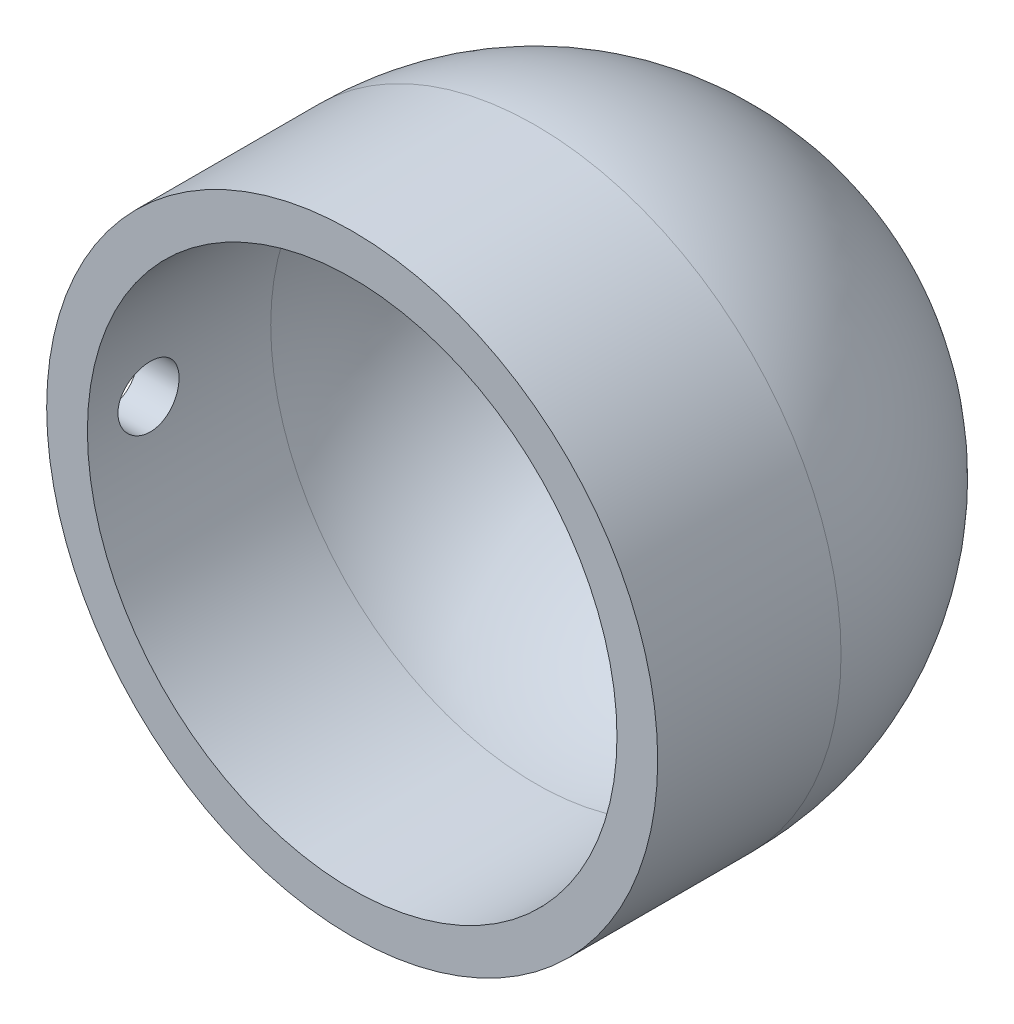
ISO-10303-21;
HEADER;
FILE_DESCRIPTION(('STEP AP214'),'2;1');
FILE_NAME('part.step','',(''),(''),'','','');
FILE_SCHEMA(('AUTOMOTIVE_DESIGN { 1 0 10303 214 1 1 1 1 }'));
ENDSEC;
DATA;
#1=APPLICATION_CONTEXT('core data for automotive mechanical design processes');
#2=APPLICATION_PROTOCOL_DEFINITION('international standard','automotive_design',2000,#1);
#3=PRODUCT_CONTEXT('',#1,'mechanical');
#4=PRODUCT('Part','Part','',(#3));
#5=PRODUCT_RELATED_PRODUCT_CATEGORY('part','',(#4));
#6=PRODUCT_DEFINITION_FORMATION('','',#4);
#7=PRODUCT_DEFINITION_CONTEXT('part definition',#1,'design');
#8=PRODUCT_DEFINITION('design','',#6,#7);
#9=PRODUCT_DEFINITION_SHAPE('','',#8);
#10=(LENGTH_UNIT() NAMED_UNIT(*) SI_UNIT(.MILLI.,.METRE.));
#11=(NAMED_UNIT(*) PLANE_ANGLE_UNIT() SI_UNIT($,.RADIAN.));
#12=(NAMED_UNIT(*) SI_UNIT($,.STERADIAN.) SOLID_ANGLE_UNIT());
#13=UNCERTAINTY_MEASURE_WITH_UNIT(LENGTH_MEASURE(1.E-05),#10,'distance_accuracy_value','');
#14=(GEOMETRIC_REPRESENTATION_CONTEXT(3) GLOBAL_UNCERTAINTY_ASSIGNED_CONTEXT((#13)) GLOBAL_UNIT_ASSIGNED_CONTEXT((#10,
#11,#12)) REPRESENTATION_CONTEXT('',''));
#15=CARTESIAN_POINT('',(0.,0.,0.));
#16=DIRECTION('',(0.,0.,1.));
#17=DIRECTION('',(1.,0.,0.));
#18=AXIS2_PLACEMENT_3D('',#15,#16,#17);
#19=CARTESIAN_POINT('',(15.,0.,-26.3920005806907));
#20=DIRECTION('',(0.,0.,-1.));
#21=DIRECTION('',(-1.,0.,0.));
#22=AXIS2_PLACEMENT_3D('',#19,#20,#21);
#23=CYLINDRICAL_SURFACE('',#22,13.);
#24=CARTESIAN_POINT('',(15.,0.,8.99999999999999));
#25=DIRECTION('',(0.,0.,-1.));
#26=DIRECTION('',(-1.,0.,0.));
#27=AXIS2_PLACEMENT_3D('',#24,#25,#26);
#28=CIRCLE('',#27,13.);
#29=CARTESIAN_POINT('',(2.,0.,8.99999999999999));
#30=VERTEX_POINT('',#29);
#31=EDGE_CURVE('E68',#30,#30,#28,.T.);
#32=ORIENTED_EDGE('',*,*,#31,.F.);
#33=EDGE_LOOP('',(#32));
#34=FACE_BOUND('',#33,.T.);
#35=CARTESIAN_POINT('',(15.,0.,0.));
#36=DIRECTION('',(0.,0.,-1.));
#37=DIRECTION('',(-1.,0.,0.));
#38=AXIS2_PLACEMENT_3D('',#35,#36,#37);
#39=CIRCLE('',#38,13.);
#40=CARTESIAN_POINT('',(2.,0.,0.));
#41=VERTEX_POINT('',#40);
#42=EDGE_CURVE('E52',#41,#41,#39,.T.);
#43=ORIENTED_EDGE('',*,*,#42,.T.);
#44=EDGE_LOOP('',(#43));
#45=FACE_BOUND('',#44,.T.);
#46=CARTESIAN_POINT('',(2.,0.,7.49999999999999));
#47=CARTESIAN_POINT('',(2.00000109554849,-0.0839563147427423,7.49999640316709));
#48=CARTESIAN_POINT('',(2.00082191842796,-0.167966345196188,7.49292758496519));
#49=CARTESIAN_POINT('',(2.00401740038599,-0.333652235419372,7.46483826496662));
#50=CARTESIAN_POINT('',(2.00639371863995,-0.415325505475653,7.44380286531638));
#51=CARTESIAN_POINT('',(2.01243226481309,-0.57391497224922,7.38840533385724));
#52=CARTESIAN_POINT('',(2.01609366337935,-0.650834199520698,7.35405179569065));
#53=CARTESIAN_POINT('',(2.02429425264015,-0.79779979378714,7.27301111812132));
#54=CARTESIAN_POINT('',(2.02883328291911,-0.867847413269117,7.22632623210123));
#55=CARTESIAN_POINT('',(2.03830564487917,-0.999427807179226,7.12171196440117));
#56=CARTESIAN_POINT('',(2.04324055671679,-1.06092347729183,7.06373605262275));
#57=CARTESIAN_POINT('',(2.05293561442349,-1.17333502414497,6.93828516324756));
#58=CARTESIAN_POINT('',(2.05769575172569,-1.2242503828419,6.87080972079665));
#59=CARTESIAN_POINT('',(2.06651803959778,-1.3141916873334,6.72803733610483));
#60=CARTESIAN_POINT('',(2.0705781611944,-1.3531833171573,6.65271863992229));
#61=CARTESIAN_POINT('',(2.07752029470133,-1.41795120910938,6.49654783804118));
#62=CARTESIAN_POINT('',(2.0804023448438,-1.44372790011126,6.41569591201296));
#63=CARTESIAN_POINT('',(2.0846471952892,-1.48122247723766,6.25113647537628));
#64=CARTESIAN_POINT('',(2.08601672134511,-1.49300261981048,6.16744332625939));
#65=CARTESIAN_POINT('',(2.08710214290088,-1.50236226854616,5.99925756045586));
#66=CARTESIAN_POINT('',(2.0868180954097,-1.49994226427626,5.91476497143115));
#67=CARTESIAN_POINT('',(2.08463461576032,-1.48102150197295,5.7478106867289));
#68=CARTESIAN_POINT('',(2.08274302261271,-1.46458907258954,5.6653411304074));
#69=CARTESIAN_POINT('',(2.07756981633314,-1.41821640637187,5.50433810598175));
#70=CARTESIAN_POINT('',(2.07428817886584,-1.38827593305336,5.42580470681433));
#71=CARTESIAN_POINT('',(2.06669569209416,-1.31566282618376,5.2746895307639));
#72=CARTESIAN_POINT('',(2.06238242677414,-1.27296024500285,5.20212227049772));
#73=CARTESIAN_POINT('',(2.05321461065443,-1.17605655290097,5.06515827049275));
#74=CARTESIAN_POINT('',(2.04836003875251,-1.12185499363063,5.00076184949449));
#75=CARTESIAN_POINT('',(2.03862170504837,-1.0031120359915,4.88157071619168));
#76=CARTESIAN_POINT('',(2.03373793950815,-0.938511694342139,4.82683470870206));
#77=CARTESIAN_POINT('',(2.02451830307243,-0.80100859223603,4.72897438783242));
#78=CARTESIAN_POINT('',(2.0201824331433,-0.728105817136099,4.68585009493268));
#79=CARTESIAN_POINT('',(2.01254497879218,-0.576023905679871,4.61243828715518));
#80=CARTESIAN_POINT('',(2.00924366751247,-0.496843118716625,4.58215416157141));
#81=CARTESIAN_POINT('',(2.00404988225952,-0.334473831095743,4.5353274726576));
#82=CARTESIAN_POINT('',(2.00215735213526,-0.251285490311375,4.51878436163703));
#83=CARTESIAN_POINT('',(2.00000162634102,-0.0837704200050174,4.49998472362037));
#84=CARTESIAN_POINT('',(1.99972920158725,0.000547113543200646,4.49764727106811));
#85=CARTESIAN_POINT('',(2.0008195330866,0.168372695685006,4.50711215461104));
#86=CARTESIAN_POINT('',(2.00218225977024,0.251880758889223,4.51891423501222));
#87=CARTESIAN_POINT('',(2.00638397275698,0.415480266956156,4.556255972808));
#88=CARTESIAN_POINT('',(2.00921884239614,0.49558056887289,4.58175732870876));
#89=CARTESIAN_POINT('',(2.01604720707884,0.650367161714354,4.64573409622904));
#90=CARTESIAN_POINT('',(2.02004073608534,0.725053293857113,4.68420988816443));
#91=CARTESIAN_POINT('',(2.02876362145451,0.867254744569762,4.77324114512288));
#92=CARTESIAN_POINT('',(2.03349615485744,0.934736878832463,4.82384929591281));
#93=CARTESIAN_POINT('',(2.0431569113652,1.06027784673838,4.93563374481515));
#94=CARTESIAN_POINT('',(2.04808514104889,1.11833636324618,4.99681039844914));
#95=CARTESIAN_POINT('',(2.0576100397556,1.22366664140002,5.12835038533593));
#96=CARTESIAN_POINT('',(2.06220499323315,1.27088497439797,5.19875664350889));
#97=CARTESIAN_POINT('',(2.07051567897646,1.35282617315314,5.34654757584496));
#98=CARTESIAN_POINT('',(2.07423142662564,1.38754925754463,5.4239321278765));
#99=CARTESIAN_POINT('',(2.08035165335215,1.44342658284102,5.58330615373548));
#100=CARTESIAN_POINT('',(2.08275910754003,1.46461162925533,5.66528470793035));
#101=CARTESIAN_POINT('',(2.08599896197759,1.49291104062265,5.83166493951435));
#102=CARTESIAN_POINT('',(2.08683142385325,1.50002595610949,5.91606652196452));
#103=CARTESIAN_POINT('',(2.08682543682194,1.49997405326829,6.08436565375942));
#104=CARTESIAN_POINT('',(2.08599680740422,1.49289116482699,6.16826324181099));
#105=CARTESIAN_POINT('',(2.08278304171944,1.46482172327171,6.33366750199321));
#106=CARTESIAN_POINT('',(2.08039790456775,1.44383516225564,6.41517417276497));
#107=CARTESIAN_POINT('',(2.07434277485117,1.38857911797313,6.57347609168934));
#108=CARTESIAN_POINT('',(2.07067311190447,1.35431304208042,6.65027254258118));
#109=CARTESIAN_POINT('',(2.06246180985034,1.27347900341466,6.79703840038788));
#110=CARTESIAN_POINT('',(2.05792016624986,1.22691097725304,6.86700777212213));
#111=CARTESIAN_POINT('',(2.04844443999922,1.12248173071088,6.99856295332931));
#112=CARTESIAN_POINT('',(2.04350827609663,1.06455790771248,7.06009892117498));
#113=CARTESIAN_POINT('',(2.03381836444263,0.93919005418629,7.17261111489076));
#114=CARTESIAN_POINT('',(2.02906466024013,0.871743768617549,7.22358483240876));
#115=CARTESIAN_POINT('',(2.02025848225609,0.728996893197093,7.31366356407028));
#116=CARTESIAN_POINT('',(2.01620834733634,0.653671391511423,7.35272930568543));
#117=CARTESIAN_POINT('',(2.00928989233055,0.497527270565885,7.41760310503945));
#118=CARTESIAN_POINT('',(2.00642026885197,0.4167148249134,7.44342579213557));
#119=CARTESIAN_POINT('',(2.00289001753647,0.279556305332051,7.47479285483811));
#120=CARTESIAN_POINT('',(2.00181144722419,0.224080319679963,7.48423222713368));
#121=CARTESIAN_POINT('',(2.00036607378108,0.112410914672189,7.49683698528068));
#122=CARTESIAN_POINT('',(1.99999926641615,0.0562174995863226,7.50000240845435));
#123=CARTESIAN_POINT('',(2.,0.,7.49999999999999));
#124=B_SPLINE_CURVE_WITH_KNOTS('',3,(#46,#47,#48,#49,#50,#51,#52,#53,#54,#55,#56,#57,#58,#59,
#60,#61,#62,#63,#64,#65,#66,#67,#68,#69,#70,#71,#72,#73,#74,#75,#76,#77,#78,#79,#80,#81,#82,#83,
#84,#85,#86,#87,#88,#89,#90,#91,#92,#93,#94,#95,#96,#97,#98,#99,#100,#101,#102,#103,#104,#105,
#106,#107,#108,#109,#110,#111,#112,#113,#114,#115,#116,#117,#118,#119,#120,#121,#122,#123),
.UNSPECIFIED.,.T.,.F.,(4,2,2,2,2,2,2,2,2,2,2,2,2,2,2,2,2,2,2,2,2,2,2,2,2,2,2,2,2,2,2,2,2,2,2,2,
2,2,4),(0.,0.251663624421979,0.503596125244171,0.755366334321088,1.00709056767771,
1.25987498270023,1.51267177188699,1.76618939688668,2.0196987937799,2.27207631201581,
2.52444512928255,2.77559031440111,3.02673989646913,3.27848351780672,3.53023695652505,
3.78347119880911,4.0367058877347,4.29000737900445,4.54329877367693,4.79514587715501,
5.04698842639316,5.29813049175019,5.54927991940194,5.80154039645154,6.05380936112788,
6.30729621090899,6.56077862511548,6.81368217226278,7.0665758236448,7.31797891068329,
7.56938214060554,7.82072090595902,8.07206096641734,8.32482769676521,8.57765438622356,
8.83130609524226,9.08467699305617,9.25319301127889,9.42170802703663),.UNSPECIFIED.);
#125=CARTESIAN_POINT('',(2.,0.,7.49999999999999));
#126=VERTEX_POINT('',#125);
#127=EDGE_CURVE('E72',#126,#126,#124,.T.);
#128=ORIENTED_EDGE('',*,*,#127,.F.);
#129=EDGE_LOOP('',(#128));
#130=FACE_BOUND('',#129,.T.);
#131=ADVANCED_FACE('F39',(#34,#45,#130),#23,.F.);
#132=CARTESIAN_POINT('',(15.,0.,-26.3920005806907));
#133=DIRECTION('',(0.,0.,-1.));
#134=DIRECTION('',(-1.,0.,0.));
#135=AXIS2_PLACEMENT_3D('',#132,#133,#134);
#136=CYLINDRICAL_SURFACE('',#135,15.);
#137=CARTESIAN_POINT('',(15.,0.,8.99999999999999));
#138=DIRECTION('',(0.,0.,-1.));
#139=DIRECTION('',(-1.,0.,0.));
#140=AXIS2_PLACEMENT_3D('',#137,#138,#139);
#141=CIRCLE('',#140,15.);
#142=CARTESIAN_POINT('',(0.,0.,8.99999999999999));
#143=VERTEX_POINT('',#142);
#144=EDGE_CURVE('E62',#143,#143,#141,.T.);
#145=ORIENTED_EDGE('',*,*,#144,.T.);
#146=EDGE_LOOP('',(#145));
#147=FACE_BOUND('',#146,.T.);
#148=CARTESIAN_POINT('',(15.,0.,0.));
#149=DIRECTION('',(0.,0.,-1.));
#150=DIRECTION('',(-1.,0.,0.));
#151=AXIS2_PLACEMENT_3D('',#148,#149,#150);
#152=CIRCLE('',#151,15.);
#153=CARTESIAN_POINT('',(0.,0.,0.));
#154=VERTEX_POINT('',#153);
#155=EDGE_CURVE('E57',#154,#154,#152,.T.);
#156=ORIENTED_EDGE('',*,*,#155,.F.);
#157=EDGE_LOOP('',(#156));
#158=FACE_BOUND('',#157,.T.);
#159=CARTESIAN_POINT('',(0.,0.,7.49999999999999));
#160=CARTESIAN_POINT('',(9.67188458413933E-07,-0.0840305306873359,7.49999636114942));
#161=CARTESIAN_POINT('',(0.000713616056915137,-0.16811661775166,7.49291509665533));
#162=CARTESIAN_POINT('',(0.00348798607893855,-0.333957597745256,7.46477344456435));
#163=CARTESIAN_POINT('',(0.00555119348961358,-0.415709818753242,7.44369765596311));
#164=CARTESIAN_POINT('',(0.0107937815539476,-0.574457513180122,7.38818663910325));
#165=CARTESIAN_POINT('',(0.0139724879893805,-0.651455826922364,7.35375947922228));
#166=CARTESIAN_POINT('',(0.0210906390854091,-0.79856424144061,7.27253863810253));
#167=CARTESIAN_POINT('',(0.0250299324280269,-0.868675708168615,7.22574741599979));
#168=CARTESIAN_POINT('',(0.0332438348801435,-1.00028932601112,7.12094595350658));
#169=CARTESIAN_POINT('',(0.0375194763920188,-1.06176321725234,7.06290030089694));
#170=CARTESIAN_POINT('',(0.0459156464060647,-1.17411378214648,6.93731319860545));
#171=CARTESIAN_POINT('',(0.0500361677262477,-1.22498996562398,6.86977130993641));
#172=CARTESIAN_POINT('',(0.0576661267082419,-1.31480095566543,6.72693220247456));
#173=CARTESIAN_POINT('',(0.0611742493364262,-1.35371019818232,6.65161883385771));
#174=CARTESIAN_POINT('',(0.0671694368021369,-1.41831957711414,6.49548662114253));
#175=CARTESIAN_POINT('',(0.0696565268666702,-1.44402003988694,6.41466791312407));
#176=CARTESIAN_POINT('',(0.0733187389053391,-1.48139856240284,6.25010729870098));
#177=CARTESIAN_POINT('',(0.0744982440285567,-1.49312347950569,6.16637613472168));
#178=CARTESIAN_POINT('',(0.0754253540921162,-1.50236292770304,5.99812670490632));
#179=CARTESIAN_POINT('',(0.0751729966688142,-1.4998778323062,5.91360845981691));
#180=CARTESIAN_POINT('',(0.073268896515984,-1.48080642037902,5.74650703546002));
#181=CARTESIAN_POINT('',(0.0716222311402345,-1.46427126618683,5.66391795100695));
#182=CARTESIAN_POINT('',(0.0671229856887231,-1.41764871622588,5.50269305519835));
#183=CARTESIAN_POINT('',(0.0642703893226234,-1.38756113738362,5.42405729726245));
#184=CARTESIAN_POINT('',(0.0576748582189473,-1.31463134082226,5.27280961905166));
#185=CARTESIAN_POINT('',(0.0539303413776407,-1.27176642407997,5.20020871576602));
#186=CARTESIAN_POINT('',(0.0459742240068177,-1.17451504102984,5.06321217763217));
#187=CARTESIAN_POINT('',(0.0417626098082316,-1.12012823750476,4.99881678302735));
#188=CARTESIAN_POINT('',(0.0333242203051613,-1.0010911686181,4.87976190901645));
#189=CARTESIAN_POINT('',(0.0290974600050396,-0.936396718277046,4.82514659717879));
#190=CARTESIAN_POINT('',(0.0211225638222279,-0.798734222605669,4.72754455063441));
#191=CARTESIAN_POINT('',(0.0173744284761581,-0.725766167999402,4.68455782896528));
#192=CARTESIAN_POINT('',(0.0107778649935594,-0.573597158538547,4.61143496953461));
#193=CARTESIAN_POINT('',(0.00792959377845819,-0.494395119584855,4.5813010727729));
#194=CARTESIAN_POINT('',(0.0034552883788725,-0.332020825994899,4.53477162493237));
#195=CARTESIAN_POINT('',(0.00182921764405036,-0.248848690164901,4.51837566301406));
#196=CARTESIAN_POINT('',(-1.27750246629998E-05,-0.0812776486378565,4.49984353839785));
#197=CARTESIAN_POINT('',(-0.000234724016034092,0.00311445315823728,4.49764642762124));
#198=CARTESIAN_POINT('',(0.00074037364804638,0.171065689973549,4.50741429457314));
#199=CARTESIAN_POINT('',(0.00193740113297675,0.254624836230704,4.51937908097291));
#200=CARTESIAN_POINT('',(0.00561207691209253,0.418362310252012,4.55708054313236));
#201=CARTESIAN_POINT('',(0.00808707122941127,0.498547273458029,4.58278868171701));
#202=CARTESIAN_POINT('',(0.0140400170908613,0.653466482075672,4.6472177610559));
#203=CARTESIAN_POINT('',(0.017517991121194,0.728200605235676,4.68593899355909));
#204=CARTESIAN_POINT('',(0.0251028700436697,0.870372270258213,4.77544625799586));
#205=CARTESIAN_POINT('',(0.029211845948384,0.937784489623375,4.82627233338872));
#206=CARTESIAN_POINT('',(0.0375910069571958,1.06314243496782,4.93848910161138));
#207=CARTESIAN_POINT('',(0.0418611961054275,1.12108792327376,4.99988005960547));
#208=CARTESIAN_POINT('',(0.050099637888678,1.22607916483072,5.13174986198849));
#209=CARTESIAN_POINT('',(0.054066747915373,1.27308491801931,5.20226063481392));
#210=CARTESIAN_POINT('',(0.0612325130866593,1.35458738811574,5.35021104022002));
#211=CARTESIAN_POINT('',(0.0644311787394345,1.38908427608082,5.42765057803259));
#212=CARTESIAN_POINT('',(0.0696907854892585,1.44452281302671,5.58712310919868));
#213=CARTESIAN_POINT('',(0.0717537232531731,1.46548826221779,5.66914776013667));
#214=CARTESIAN_POINT('',(0.0745145207568527,1.49334601069419,5.83557479694115));
#215=CARTESIAN_POINT('',(0.0752124196472077,1.50023871359928,5.9199771145435));
#216=CARTESIAN_POINT('',(0.075163303386568,1.49974970770688,6.08836603253505));
#217=CARTESIAN_POINT('',(0.074422648694864,1.49243083438967,6.17235282432422));
#218=CARTESIAN_POINT('',(0.0715934416568128,1.46385817944548,6.33789737575243));
#219=CARTESIAN_POINT('',(0.0695048877942264,1.44260438214324,6.41945513265896));
#220=CARTESIAN_POINT('',(0.064216976052197,1.38678252944626,6.57782602357178));
#221=CARTESIAN_POINT('',(0.0610177718945891,1.35221631651137,6.65463981244458));
#222=CARTESIAN_POINT('',(0.0538687224096182,1.27075733236657,6.80138533750655));
#223=CARTESIAN_POINT('',(0.0499188812857434,1.22386463018312,6.87131711223094));
#224=CARTESIAN_POINT('',(0.0416926918545321,1.118847834428,7.0026355117079));
#225=CARTESIAN_POINT('',(0.0374150290987404,1.0606769233354,7.06398461455062));
#226=CARTESIAN_POINT('',(0.0290271790682525,0.934847548837665,7.17607834904948));
#227=CARTESIAN_POINT('',(0.0249170321553601,0.867186816162386,7.22682043703575));
#228=CARTESIAN_POINT('',(0.0173165689625777,0.724112151241934,7.31636018078193));
#229=CARTESIAN_POINT('',(0.0138278395978189,0.648679124020145,7.35512743641777));
#230=CARTESIAN_POINT('',(0.00788056125155563,0.492387418650826,7.4193936342358));
#231=CARTESIAN_POINT('',(0.00542085135519401,0.411534974738414,7.44490753643031));
#232=CARTESIAN_POINT('',(0.0024267933939968,0.275187392108557,7.4755809256272));
#233=CARTESIAN_POINT('',(0.00152098962251066,0.220563829266764,7.48472556644903));
#234=CARTESIAN_POINT('',(0.000307275738208955,0.11063487122597,7.49693628909264));
#235=CARTESIAN_POINT('',(-6.36840359167375E-07,0.0553294788398368,7.50000239598279));
#236=CARTESIAN_POINT('',(0.,0.,7.49999999999999));
#237=B_SPLINE_CURVE_WITH_KNOTS('',3,(#159,#160,#161,#162,#163,#164,#165,#166,#167,#168,#169,
#170,#171,#172,#173,#174,#175,#176,#177,#178,#179,#180,#181,#182,#183,#184,#185,#186,#187,#188,
#189,#190,#191,#192,#193,#194,#195,#196,#197,#198,#199,#200,#201,#202,#203,#204,#205,#206,#207,
#208,#209,#210,#211,#212,#213,#214,#215,#216,#217,#218,#219,#220,#221,#222,#223,#224,#225,#226,
#227,#228,#229,#230,#231,#232,#233,#234,#235,#236),.UNSPECIFIED.,.T.,.F.,(4,2,2,2,2,2,2,2,2,2,2,
2,2,2,2,2,2,2,2,2,2,2,2,2,2,2,2,2,2,2,2,2,2,2,2,2,2,2,4),(0.,0.251889549402711,
0.504056764253229,0.756071828598304,1.00803680637417,1.26080785293442,1.51359058831059,
1.76690963208333,2.02022241663756,2.27268348067795,2.52513790883665,2.77667696161666,
3.02821941242451,3.28021142059342,3.53221080496688,3.7853210129431,4.03843150469658,
4.29158611040372,4.54473314513159,4.79679282911637,5.04884910778715,5.30038402941457,
5.551924590742,5.80430911123048,6.05669996715345,6.30999965412898,6.56329587713061,
6.81614535889505,7.06898758859378,7.32071443940935,7.5724415733906,7.824133880442,
8.0758247780844,8.3285837614148,8.58140328955437,8.83485946539364,9.08802892192943,
9.25388500848523,9.41974041103541),.UNSPECIFIED.);
#238=CARTESIAN_POINT('',(0.,0.,7.49999999999999));
#239=VERTEX_POINT('',#238);
#240=EDGE_CURVE('E10',#239,#239,#237,.T.);
#241=ORIENTED_EDGE('',*,*,#240,.T.);
#242=EDGE_LOOP('',(#241));
#243=FACE_BOUND('',#242,.T.);
#244=ADVANCED_FACE('F88',(#147,#158,#243),#136,.T.);
#245=CARTESIAN_POINT('',(15.,0.,0.));
#246=DIRECTION('',(0.,0.,-1.));
#247=DIRECTION('',(-1.,0.,0.));
#248=AXIS2_PLACEMENT_3D('',#245,#246,#247);
#249=SPHERICAL_SURFACE('',#248,13.);
#250=ORIENTED_EDGE('',*,*,#42,.F.);
#251=EDGE_LOOP('',(#250));
#252=FACE_BOUND('',#251,.T.);
#253=ADVANCED_FACE('F92',(#252),#249,.F.);
#254=CARTESIAN_POINT('',(15.,0.,0.));
#255=DIRECTION('',(0.,0.,-1.));
#256=DIRECTION('',(-1.,0.,0.));
#257=AXIS2_PLACEMENT_3D('',#254,#255,#256);
#258=SPHERICAL_SURFACE('',#257,15.);
#259=ORIENTED_EDGE('',*,*,#155,.T.);
#260=EDGE_LOOP('',(#259));
#261=FACE_BOUND('',#260,.T.);
#262=ADVANCED_FACE('F86',(#261),#258,.T.);
#263=CARTESIAN_POINT('',(0.,0.,9.));
#264=DIRECTION('',(0.,0.,1.));
#265=DIRECTION('',(1.,0.,0.));
#266=AXIS2_PLACEMENT_3D('',#263,#264,#265);
#267=PLANE('',#266);
#268=ORIENTED_EDGE('',*,*,#31,.T.);
#269=EDGE_LOOP('',(#268));
#270=FACE_BOUND('',#269,.T.);
#271=ORIENTED_EDGE('',*,*,#144,.F.);
#272=EDGE_LOOP('',(#271));
#273=FACE_BOUND('',#272,.T.);
#274=ADVANCED_FACE('F82',(#270,#273),#267,.T.);
#275=CARTESIAN_POINT('',(10.,0.,5.99999999999999));
#276=DIRECTION('',(-1.,0.,0.));
#277=DIRECTION('',(0.,0.,1.));
#278=AXIS2_PLACEMENT_3D('',#275,#276,#277);
#279=CYLINDRICAL_SURFACE('',#278,1.5);
#280=ORIENTED_EDGE('',*,*,#240,.F.);
#281=EDGE_LOOP('',(#280));
#282=FACE_BOUND('',#281,.T.);
#283=ORIENTED_EDGE('',*,*,#127,.T.);
#284=EDGE_LOOP('',(#283));
#285=FACE_BOUND('',#284,.T.);
#286=ADVANCED_FACE('F78',(#282,#285),#279,.F.);
#287=CLOSED_SHELL('',(#131,#244,#253,#262,#274,#286));
#288=MANIFOLD_SOLID_BREP('B2',#287);
#289=ADVANCED_BREP_SHAPE_REPRESENTATION('',(#18,#288),#14);
#290=SHAPE_DEFINITION_REPRESENTATION(#9,#289);
ENDSEC;
END-ISO-10303-21;
